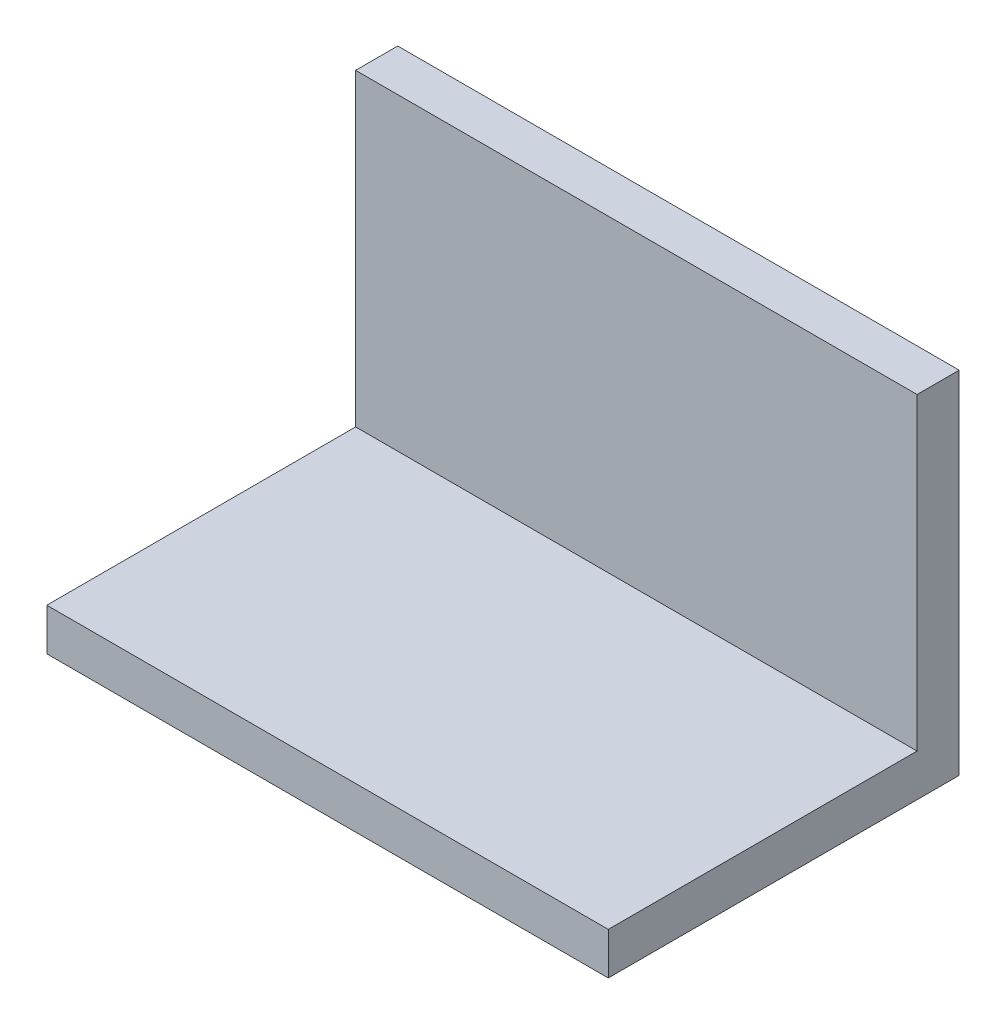
ISO-10303-21;
HEADER;
FILE_DESCRIPTION(('STEP AP214'),'2;1');
FILE_NAME('part.step','',(''),(''),'','','');
FILE_SCHEMA(('AUTOMOTIVE_DESIGN { 1 0 10303 214 1 1 1 1 }'));
ENDSEC;
DATA;
#1=APPLICATION_CONTEXT('core data for automotive mechanical design processes');
#2=APPLICATION_PROTOCOL_DEFINITION('international standard','automotive_design',2000,#1);
#3=PRODUCT_CONTEXT('',#1,'mechanical');
#4=PRODUCT('Part','Part','',(#3));
#5=PRODUCT_RELATED_PRODUCT_CATEGORY('part','',(#4));
#6=PRODUCT_DEFINITION_FORMATION('','',#4);
#7=PRODUCT_DEFINITION_CONTEXT('part definition',#1,'design');
#8=PRODUCT_DEFINITION('design','',#6,#7);
#9=PRODUCT_DEFINITION_SHAPE('','',#8);
#10=(LENGTH_UNIT() NAMED_UNIT(*) SI_UNIT(.MILLI.,.METRE.));
#11=(NAMED_UNIT(*) PLANE_ANGLE_UNIT() SI_UNIT($,.RADIAN.));
#12=(NAMED_UNIT(*) SI_UNIT($,.STERADIAN.) SOLID_ANGLE_UNIT());
#13=UNCERTAINTY_MEASURE_WITH_UNIT(LENGTH_MEASURE(1.E-05),#10,'distance_accuracy_value','');
#14=(GEOMETRIC_REPRESENTATION_CONTEXT(3) GLOBAL_UNCERTAINTY_ASSIGNED_CONTEXT((#13)) GLOBAL_UNIT_ASSIGNED_CONTEXT((#10,
#11,#12)) REPRESENTATION_CONTEXT('',''));
#15=CARTESIAN_POINT('',(0.,0.,0.));
#16=DIRECTION('',(0.,0.,1.));
#17=DIRECTION('',(1.,0.,0.));
#18=AXIS2_PLACEMENT_3D('',#15,#16,#17);
#19=CARTESIAN_POINT('',(0.,6.,0.));
#20=DIRECTION('',(0.,-1.,0.));
#21=DIRECTION('',(0.,0.,-1.));
#22=AXIS2_PLACEMENT_3D('',#19,#20,#21);
#23=PLANE('',#22);
#24=DIRECTION('',(1.,0.,0.));
#25=VECTOR('',#24,1.);
#26=CARTESIAN_POINT('',(-40.,6.,-19.));
#27=LINE('',#26,#25);
#28=CARTESIAN_POINT('',(-40.,6.,-19.));
#29=VERTEX_POINT('',#28);
#30=CARTESIAN_POINT('',(40.,6.,-19.));
#31=VERTEX_POINT('',#30);
#32=EDGE_CURVE('E51',#29,#31,#27,.T.);
#33=ORIENTED_EDGE('',*,*,#32,.F.);
#34=DIRECTION('',(0.,0.,1.));
#35=VECTOR('',#34,1.);
#36=CARTESIAN_POINT('',(-40.,6.,25.));
#37=LINE('',#36,#35);
#38=CARTESIAN_POINT('',(-40.,6.,25.));
#39=VERTEX_POINT('',#38);
#40=EDGE_CURVE('E111',#29,#39,#37,.T.);
#41=ORIENTED_EDGE('',*,*,#40,.T.);
#42=DIRECTION('',(1.,0.,0.));
#43=VECTOR('',#42,1.);
#44=CARTESIAN_POINT('',(-40.,6.,25.));
#45=LINE('',#44,#43);
#46=CARTESIAN_POINT('',(40.,6.,25.));
#47=VERTEX_POINT('',#46);
#48=EDGE_CURVE('E57',#39,#47,#45,.T.);
#49=ORIENTED_EDGE('',*,*,#48,.T.);
#50=DIRECTION('',(0.,0.,-1.));
#51=VECTOR('',#50,1.);
#52=CARTESIAN_POINT('',(40.,6.,25.));
#53=LINE('',#52,#51);
#54=EDGE_CURVE('E86',#47,#31,#53,.T.);
#55=ORIENTED_EDGE('',*,*,#54,.T.);
#56=EDGE_LOOP('',(#33,#41,#49,#55));
#57=FACE_BOUND('',#56,.T.);
#58=ADVANCED_FACE('F34',(#57),#23,.F.);
#59=CARTESIAN_POINT('',(40.,6.,25.));
#60=DIRECTION('',(-1.,0.,0.));
#61=DIRECTION('',(0.,0.,1.));
#62=AXIS2_PLACEMENT_3D('',#59,#60,#61);
#63=PLANE('',#62);
#64=DIRECTION('',(0.,0.,-1.));
#65=VECTOR('',#64,1.);
#66=CARTESIAN_POINT('',(40.,0.,25.));
#67=LINE('',#66,#65);
#68=CARTESIAN_POINT('',(40.,0.,25.));
#69=VERTEX_POINT('',#68);
#70=CARTESIAN_POINT('',(40.,0.,-25.));
#71=VERTEX_POINT('',#70);
#72=EDGE_CURVE('E92',#69,#71,#67,.T.);
#73=ORIENTED_EDGE('',*,*,#72,.T.);
#74=DIRECTION('',(0.,-1.,0.));
#75=VECTOR('',#74,1.);
#76=CARTESIAN_POINT('',(40.,6.,-25.));
#77=LINE('',#76,#75);
#78=CARTESIAN_POINT('',(40.,50.,-25.));
#79=VERTEX_POINT('',#78);
#80=EDGE_CURVE('E11',#79,#71,#77,.T.);
#81=ORIENTED_EDGE('',*,*,#80,.F.);
#82=DIRECTION('',(0.,0.,-1.));
#83=VECTOR('',#82,1.);
#84=CARTESIAN_POINT('',(40.,50.,-19.));
#85=LINE('',#84,#83);
#86=CARTESIAN_POINT('',(40.,50.,-19.));
#87=VERTEX_POINT('',#86);
#88=EDGE_CURVE('E128',#87,#79,#85,.T.);
#89=ORIENTED_EDGE('',*,*,#88,.F.);
#90=DIRECTION('',(0.,-1.,0.));
#91=VECTOR('',#90,1.);
#92=CARTESIAN_POINT('',(40.,50.,-19.));
#93=LINE('',#92,#91);
#94=EDGE_CURVE('E101',#87,#31,#93,.T.);
#95=ORIENTED_EDGE('',*,*,#94,.T.);
#96=ORIENTED_EDGE('',*,*,#54,.F.);
#97=DIRECTION('',(0.,-1.,0.));
#98=VECTOR('',#97,1.);
#99=CARTESIAN_POINT('',(40.,6.,25.));
#100=LINE('',#99,#98);
#101=EDGE_CURVE('E79',#47,#69,#100,.T.);
#102=ORIENTED_EDGE('',*,*,#101,.T.);
#103=EDGE_LOOP('',(#73,#81,#89,#95,#96,#102));
#104=FACE_BOUND('',#103,.T.);
#105=ADVANCED_FACE('F36',(#104),#63,.F.);
#106=CARTESIAN_POINT('',(-40.,6.,-25.));
#107=DIRECTION('',(0.,0.,1.));
#108=DIRECTION('',(1.,0.,0.));
#109=AXIS2_PLACEMENT_3D('',#106,#107,#108);
#110=PLANE('',#109);
#111=DIRECTION('',(-1.,0.,0.));
#112=VECTOR('',#111,1.);
#113=CARTESIAN_POINT('',(-40.,0.,-25.));
#114=LINE('',#113,#112);
#115=CARTESIAN_POINT('',(-40.,0.,-25.));
#116=VERTEX_POINT('',#115);
#117=EDGE_CURVE('E96',#71,#116,#114,.T.);
#118=ORIENTED_EDGE('',*,*,#117,.T.);
#119=DIRECTION('',(0.,-1.,0.));
#120=VECTOR('',#119,1.);
#121=CARTESIAN_POINT('',(-40.,6.,-25.));
#122=LINE('',#121,#120);
#123=CARTESIAN_POINT('',(-40.,50.,-25.));
#124=VERTEX_POINT('',#123);
#125=EDGE_CURVE('E43',#124,#116,#122,.T.);
#126=ORIENTED_EDGE('',*,*,#125,.F.);
#127=DIRECTION('',(-1.,0.,0.));
#128=VECTOR('',#127,1.);
#129=CARTESIAN_POINT('',(-40.,50.,-25.));
#130=LINE('',#129,#128);
#131=EDGE_CURVE('E118',#79,#124,#130,.T.);
#132=ORIENTED_EDGE('',*,*,#131,.F.);
#133=ORIENTED_EDGE('',*,*,#80,.T.);
#134=EDGE_LOOP('',(#118,#126,#132,#133));
#135=FACE_BOUND('',#134,.T.);
#136=ADVANCED_FACE('F152',(#135),#110,.F.);
#137=CARTESIAN_POINT('',(-40.,6.,25.));
#138=DIRECTION('',(1.,0.,0.));
#139=DIRECTION('',(0.,0.,-1.));
#140=AXIS2_PLACEMENT_3D('',#137,#138,#139);
#141=PLANE('',#140);
#142=DIRECTION('',(0.,0.,1.));
#143=VECTOR('',#142,1.);
#144=CARTESIAN_POINT('',(-40.,0.,25.));
#145=LINE('',#144,#143);
#146=CARTESIAN_POINT('',(-40.,0.,25.));
#147=VERTEX_POINT('',#146);
#148=EDGE_CURVE('E87',#116,#147,#145,.T.);
#149=ORIENTED_EDGE('',*,*,#148,.T.);
#150=DIRECTION('',(0.,-1.,0.));
#151=VECTOR('',#150,1.);
#152=CARTESIAN_POINT('',(-40.,6.,25.));
#153=LINE('',#152,#151);
#154=EDGE_CURVE('E82',#39,#147,#153,.T.);
#155=ORIENTED_EDGE('',*,*,#154,.F.);
#156=ORIENTED_EDGE('',*,*,#40,.F.);
#157=DIRECTION('',(0.,-1.,0.));
#158=VECTOR('',#157,1.);
#159=CARTESIAN_POINT('',(-40.,50.,-19.));
#160=LINE('',#159,#158);
#161=CARTESIAN_POINT('',(-40.,50.,-19.));
#162=VERTEX_POINT('',#161);
#163=EDGE_CURVE('E97',#162,#29,#160,.T.);
#164=ORIENTED_EDGE('',*,*,#163,.F.);
#165=DIRECTION('',(0.,0.,1.));
#166=VECTOR('',#165,1.);
#167=CARTESIAN_POINT('',(-40.,50.,-19.));
#168=LINE('',#167,#166);
#169=EDGE_CURVE('E121',#124,#162,#168,.T.);
#170=ORIENTED_EDGE('',*,*,#169,.F.);
#171=ORIENTED_EDGE('',*,*,#125,.T.);
#172=EDGE_LOOP('',(#149,#155,#156,#164,#170,#171));
#173=FACE_BOUND('',#172,.T.);
#174=ADVANCED_FACE('F146',(#173),#141,.F.);
#175=CARTESIAN_POINT('',(-40.,6.,25.));
#176=DIRECTION('',(0.,0.,-1.));
#177=DIRECTION('',(-1.,0.,0.));
#178=AXIS2_PLACEMENT_3D('',#175,#176,#177);
#179=PLANE('',#178);
#180=DIRECTION('',(1.,0.,0.));
#181=VECTOR('',#180,1.);
#182=CARTESIAN_POINT('',(-40.,0.,25.));
#183=LINE('',#182,#181);
#184=EDGE_CURVE('E76',#147,#69,#183,.T.);
#185=ORIENTED_EDGE('',*,*,#184,.T.);
#186=ORIENTED_EDGE('',*,*,#101,.F.);
#187=ORIENTED_EDGE('',*,*,#48,.F.);
#188=ORIENTED_EDGE('',*,*,#154,.T.);
#189=EDGE_LOOP('',(#185,#186,#187,#188));
#190=FACE_BOUND('',#189,.T.);
#191=ADVANCED_FACE('F78',(#190),#179,.F.);
#192=CARTESIAN_POINT('',(0.,0.,0.));
#193=DIRECTION('',(0.,-1.,0.));
#194=DIRECTION('',(0.,0.,-1.));
#195=AXIS2_PLACEMENT_3D('',#192,#193,#194);
#196=PLANE('',#195);
#197=ORIENTED_EDGE('',*,*,#72,.F.);
#198=ORIENTED_EDGE('',*,*,#184,.F.);
#199=ORIENTED_EDGE('',*,*,#148,.F.);
#200=ORIENTED_EDGE('',*,*,#117,.F.);
#201=EDGE_LOOP('',(#197,#198,#199,#200));
#202=FACE_BOUND('',#201,.T.);
#203=ADVANCED_FACE('F95',(#202),#196,.T.);
#204=CARTESIAN_POINT('',(-40.,50.,-19.));
#205=DIRECTION('',(0.,0.,-1.));
#206=DIRECTION('',(-1.,0.,0.));
#207=AXIS2_PLACEMENT_3D('',#204,#205,#206);
#208=PLANE('',#207);
#209=ORIENTED_EDGE('',*,*,#32,.T.);
#210=ORIENTED_EDGE('',*,*,#94,.F.);
#211=DIRECTION('',(1.,0.,0.));
#212=VECTOR('',#211,1.);
#213=CARTESIAN_POINT('',(-40.,50.,-19.));
#214=LINE('',#213,#212);
#215=EDGE_CURVE('E134',#162,#87,#214,.T.);
#216=ORIENTED_EDGE('',*,*,#215,.F.);
#217=ORIENTED_EDGE('',*,*,#163,.T.);
#218=EDGE_LOOP('',(#209,#210,#216,#217));
#219=FACE_BOUND('',#218,.T.);
#220=ADVANCED_FACE('F148',(#219),#208,.F.);
#221=CARTESIAN_POINT('',(0.,50.,0.));
#222=DIRECTION('',(0.,-1.,0.));
#223=DIRECTION('',(0.,0.,-1.));
#224=AXIS2_PLACEMENT_3D('',#221,#222,#223);
#225=PLANE('',#224);
#226=ORIENTED_EDGE('',*,*,#169,.T.);
#227=ORIENTED_EDGE('',*,*,#215,.T.);
#228=ORIENTED_EDGE('',*,*,#88,.T.);
#229=ORIENTED_EDGE('',*,*,#131,.T.);
#230=EDGE_LOOP('',(#226,#227,#228,#229));
#231=FACE_BOUND('',#230,.T.);
#232=ADVANCED_FACE('F141',(#231),#225,.F.);
#233=CLOSED_SHELL('',(#58,#105,#136,#174,#191,#203,#220,#232));
#234=MANIFOLD_SOLID_BREP('B2',#233);
#235=ADVANCED_BREP_SHAPE_REPRESENTATION('',(#18,#234),#14);
#236=SHAPE_DEFINITION_REPRESENTATION(#9,#235);
ENDSEC;
END-ISO-10303-21;
